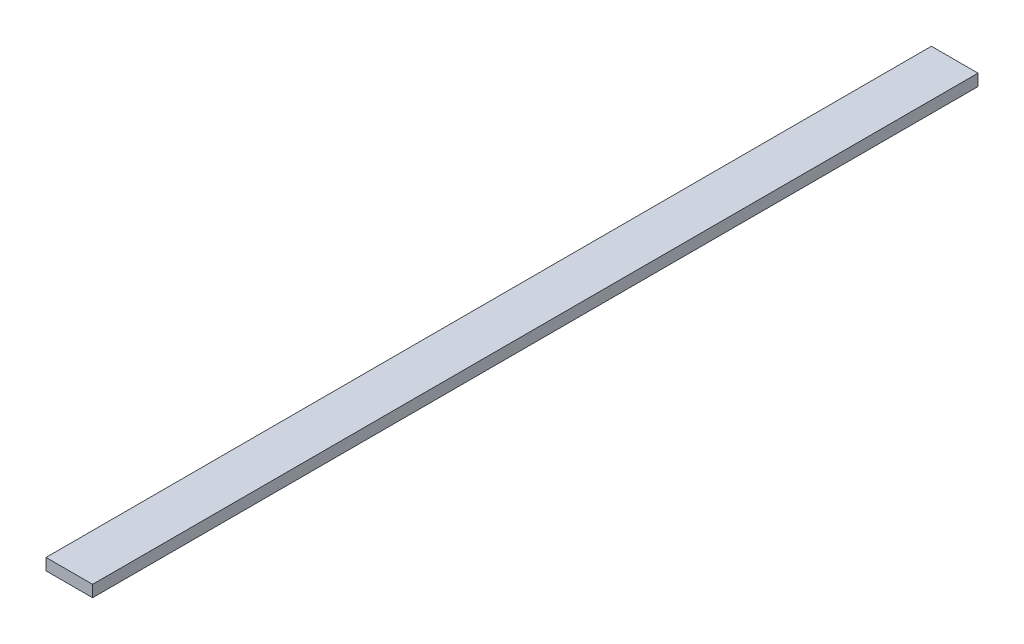
ISO-10303-21;
HEADER;
FILE_DESCRIPTION(('STEP AP214'),'2;1');
FILE_NAME('part.step','',(''),(''),'','','');
FILE_SCHEMA(('AUTOMOTIVE_DESIGN { 1 0 10303 214 1 1 1 1 }'));
ENDSEC;
DATA;
#1=APPLICATION_CONTEXT('core data for automotive mechanical design processes');
#2=APPLICATION_PROTOCOL_DEFINITION('international standard','automotive_design',2000,#1);
#3=PRODUCT_CONTEXT('',#1,'mechanical');
#4=PRODUCT('Part','Part','',(#3));
#5=PRODUCT_RELATED_PRODUCT_CATEGORY('part','',(#4));
#6=PRODUCT_DEFINITION_FORMATION('','',#4);
#7=PRODUCT_DEFINITION_CONTEXT('part definition',#1,'design');
#8=PRODUCT_DEFINITION('design','',#6,#7);
#9=PRODUCT_DEFINITION_SHAPE('','',#8);
#10=(LENGTH_UNIT() NAMED_UNIT(*) SI_UNIT(.MILLI.,.METRE.));
#11=(NAMED_UNIT(*) PLANE_ANGLE_UNIT() SI_UNIT($,.RADIAN.));
#12=(NAMED_UNIT(*) SI_UNIT($,.STERADIAN.) SOLID_ANGLE_UNIT());
#13=UNCERTAINTY_MEASURE_WITH_UNIT(LENGTH_MEASURE(1.E-05),#10,'distance_accuracy_value','');
#14=(GEOMETRIC_REPRESENTATION_CONTEXT(3) GLOBAL_UNCERTAINTY_ASSIGNED_CONTEXT((#13)) GLOBAL_UNIT_ASSIGNED_CONTEXT((#10,
#11,#12)) REPRESENTATION_CONTEXT('',''));
#15=CARTESIAN_POINT('',(0.,0.,0.));
#16=DIRECTION('',(0.,0.,1.));
#17=DIRECTION('',(1.,0.,0.));
#18=AXIS2_PLACEMENT_3D('',#15,#16,#17);
#19=CARTESIAN_POINT('',(0.,0.,241.3));
#20=DIRECTION('',(1.,0.,0.));
#21=DIRECTION('',(0.,0.,-1.));
#22=AXIS2_PLACEMENT_3D('',#19,#20,#21);
#23=PLANE('',#22);
#24=DIRECTION('',(0.,-1.,0.));
#25=VECTOR('',#24,1.);
#26=CARTESIAN_POINT('',(0.,0.,0.));
#27=LINE('',#26,#25);
#28=CARTESIAN_POINT('',(0.,3.175,0.));
#29=VERTEX_POINT('',#28);
#30=CARTESIAN_POINT('',(0.,0.,0.));
#31=VERTEX_POINT('',#30);
#32=EDGE_CURVE('E99',#29,#31,#27,.T.);
#33=ORIENTED_EDGE('',*,*,#32,.T.);
#34=DIRECTION('',(0.,0.,-1.));
#35=VECTOR('',#34,1.);
#36=CARTESIAN_POINT('',(0.,0.,241.3));
#37=LINE('',#36,#35);
#38=CARTESIAN_POINT('',(0.,0.,241.3));
#39=VERTEX_POINT('',#38);
#40=EDGE_CURVE('E11',#39,#31,#37,.T.);
#41=ORIENTED_EDGE('',*,*,#40,.F.);
#42=DIRECTION('',(0.,-1.,0.));
#43=VECTOR('',#42,1.);
#44=CARTESIAN_POINT('',(0.,0.,241.3));
#45=LINE('',#44,#43);
#46=CARTESIAN_POINT('',(0.,3.175,241.3));
#47=VERTEX_POINT('',#46);
#48=EDGE_CURVE('E87',#47,#39,#45,.T.);
#49=ORIENTED_EDGE('',*,*,#48,.F.);
#50=DIRECTION('',(0.,0.,-1.));
#51=VECTOR('',#50,1.);
#52=CARTESIAN_POINT('',(0.,3.175,241.3));
#53=LINE('',#52,#51);
#54=EDGE_CURVE('E95',#47,#29,#53,.T.);
#55=ORIENTED_EDGE('',*,*,#54,.T.);
#56=EDGE_LOOP('',(#33,#41,#49,#55));
#57=FACE_BOUND('',#56,.T.);
#58=ADVANCED_FACE('F36',(#57),#23,.F.);
#59=CARTESIAN_POINT('',(0.,0.,241.3));
#60=DIRECTION('',(0.,1.,0.));
#61=DIRECTION('',(0.,0.,1.));
#62=AXIS2_PLACEMENT_3D('',#59,#60,#61);
#63=PLANE('',#62);
#64=DIRECTION('',(1.,0.,0.));
#65=VECTOR('',#64,1.);
#66=CARTESIAN_POINT('',(0.,0.,0.));
#67=LINE('',#66,#65);
#68=CARTESIAN_POINT('',(12.7,0.,0.));
#69=VERTEX_POINT('',#68);
#70=EDGE_CURVE('E91',#31,#69,#67,.T.);
#71=ORIENTED_EDGE('',*,*,#70,.T.);
#72=DIRECTION('',(0.,0.,-1.));
#73=VECTOR('',#72,1.);
#74=CARTESIAN_POINT('',(12.7,0.,241.3));
#75=LINE('',#74,#73);
#76=CARTESIAN_POINT('',(12.7,0.,241.3));
#77=VERTEX_POINT('',#76);
#78=EDGE_CURVE('E44',#77,#69,#75,.T.);
#79=ORIENTED_EDGE('',*,*,#78,.F.);
#80=DIRECTION('',(1.,0.,0.));
#81=VECTOR('',#80,1.);
#82=CARTESIAN_POINT('',(0.,0.,241.3));
#83=LINE('',#82,#81);
#84=EDGE_CURVE('E82',#39,#77,#83,.T.);
#85=ORIENTED_EDGE('',*,*,#84,.F.);
#86=ORIENTED_EDGE('',*,*,#40,.T.);
#87=EDGE_LOOP('',(#71,#79,#85,#86));
#88=FACE_BOUND('',#87,.T.);
#89=ADVANCED_FACE('F90',(#88),#63,.F.);
#90=CARTESIAN_POINT('',(12.7,0.,241.3));
#91=DIRECTION('',(-1.,0.,0.));
#92=DIRECTION('',(0.,0.,1.));
#93=AXIS2_PLACEMENT_3D('',#90,#91,#92);
#94=PLANE('',#93);
#95=DIRECTION('',(0.,1.,0.));
#96=VECTOR('',#95,1.);
#97=CARTESIAN_POINT('',(12.7,0.,0.));
#98=LINE('',#97,#96);
#99=CARTESIAN_POINT('',(12.7,3.175,0.));
#100=VERTEX_POINT('',#99);
#101=EDGE_CURVE('E69',#69,#100,#98,.T.);
#102=ORIENTED_EDGE('',*,*,#101,.T.);
#103=DIRECTION('',(0.,0.,-1.));
#104=VECTOR('',#103,1.);
#105=CARTESIAN_POINT('',(12.7,3.175,241.3));
#106=LINE('',#105,#104);
#107=CARTESIAN_POINT('',(12.7,3.175,241.3));
#108=VERTEX_POINT('',#107);
#109=EDGE_CURVE('E92',#108,#100,#106,.T.);
#110=ORIENTED_EDGE('',*,*,#109,.F.);
#111=DIRECTION('',(0.,1.,0.));
#112=VECTOR('',#111,1.);
#113=CARTESIAN_POINT('',(12.7,0.,241.3));
#114=LINE('',#113,#112);
#115=EDGE_CURVE('E85',#77,#108,#114,.T.);
#116=ORIENTED_EDGE('',*,*,#115,.F.);
#117=ORIENTED_EDGE('',*,*,#78,.T.);
#118=EDGE_LOOP('',(#102,#110,#116,#117));
#119=FACE_BOUND('',#118,.T.);
#120=ADVANCED_FACE('F93',(#119),#94,.F.);
#121=CARTESIAN_POINT('',(0.,3.175,241.3));
#122=DIRECTION('',(0.,-1.,0.));
#123=DIRECTION('',(0.,0.,-1.));
#124=AXIS2_PLACEMENT_3D('',#121,#122,#123);
#125=PLANE('',#124);
#126=DIRECTION('',(-1.,0.,0.));
#127=VECTOR('',#126,1.);
#128=CARTESIAN_POINT('',(0.,3.175,0.));
#129=LINE('',#128,#127);
#130=EDGE_CURVE('E75',#100,#29,#129,.T.);
#131=ORIENTED_EDGE('',*,*,#130,.T.);
#132=ORIENTED_EDGE('',*,*,#54,.F.);
#133=DIRECTION('',(-1.,0.,0.));
#134=VECTOR('',#133,1.);
#135=CARTESIAN_POINT('',(0.,3.175,241.3));
#136=LINE('',#135,#134);
#137=EDGE_CURVE('E52',#108,#47,#136,.T.);
#138=ORIENTED_EDGE('',*,*,#137,.F.);
#139=ORIENTED_EDGE('',*,*,#109,.T.);
#140=EDGE_LOOP('',(#131,#132,#138,#139));
#141=FACE_BOUND('',#140,.T.);
#142=ADVANCED_FACE('F106',(#141),#125,.F.);
#143=CARTESIAN_POINT('',(0.,0.,241.3));
#144=DIRECTION('',(0.,0.,-1.));
#145=DIRECTION('',(-1.,0.,0.));
#146=AXIS2_PLACEMENT_3D('',#143,#144,#145);
#147=PLANE('',#146);
#148=ORIENTED_EDGE('',*,*,#48,.T.);
#149=ORIENTED_EDGE('',*,*,#84,.T.);
#150=ORIENTED_EDGE('',*,*,#115,.T.);
#151=ORIENTED_EDGE('',*,*,#137,.T.);
#152=EDGE_LOOP('',(#148,#149,#150,#151));
#153=FACE_BOUND('',#152,.T.);
#154=ADVANCED_FACE('F83',(#153),#147,.F.);
#155=CARTESIAN_POINT('',(0.,0.,0.));
#156=DIRECTION('',(0.,0.,-1.));
#157=DIRECTION('',(-1.,0.,0.));
#158=AXIS2_PLACEMENT_3D('',#155,#156,#157);
#159=PLANE('',#158);
#160=ORIENTED_EDGE('',*,*,#32,.F.);
#161=ORIENTED_EDGE('',*,*,#130,.F.);
#162=ORIENTED_EDGE('',*,*,#101,.F.);
#163=ORIENTED_EDGE('',*,*,#70,.F.);
#164=EDGE_LOOP('',(#160,#161,#162,#163));
#165=FACE_BOUND('',#164,.T.);
#166=ADVANCED_FACE('F109',(#165),#159,.T.);
#167=CLOSED_SHELL('',(#58,#89,#120,#142,#154,#166));
#168=MANIFOLD_SOLID_BREP('B2',#167);
#169=ADVANCED_BREP_SHAPE_REPRESENTATION('',(#18,#168),#14);
#170=SHAPE_DEFINITION_REPRESENTATION(#9,#169);
ENDSEC;
END-ISO-10303-21;
